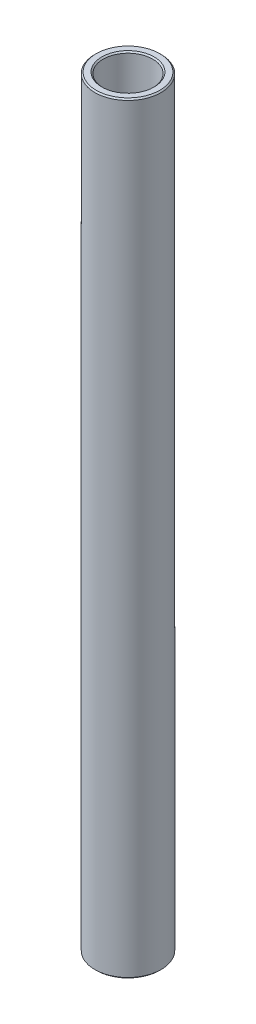
ISO-10303-21;
HEADER;
FILE_DESCRIPTION(('STEP AP214'),'2;1');
FILE_NAME('part.step','',(''),(''),'','','');
FILE_SCHEMA(('AUTOMOTIVE_DESIGN { 1 0 10303 214 1 1 1 1 }'));
ENDSEC;
DATA;
#1=APPLICATION_CONTEXT('core data for automotive mechanical design processes');
#2=APPLICATION_PROTOCOL_DEFINITION('international standard','automotive_design',2000,#1);
#3=PRODUCT_CONTEXT('',#1,'mechanical');
#4=PRODUCT('Part','Part','',(#3));
#5=PRODUCT_RELATED_PRODUCT_CATEGORY('part','',(#4));
#6=PRODUCT_DEFINITION_FORMATION('','',#4);
#7=PRODUCT_DEFINITION_CONTEXT('part definition',#1,'design');
#8=PRODUCT_DEFINITION('design','',#6,#7);
#9=PRODUCT_DEFINITION_SHAPE('','',#8);
#10=(LENGTH_UNIT() NAMED_UNIT(*) SI_UNIT(.MILLI.,.METRE.));
#11=(NAMED_UNIT(*) PLANE_ANGLE_UNIT() SI_UNIT($,.RADIAN.));
#12=(NAMED_UNIT(*) SI_UNIT($,.STERADIAN.) SOLID_ANGLE_UNIT());
#13=UNCERTAINTY_MEASURE_WITH_UNIT(LENGTH_MEASURE(1.E-05),#10,'distance_accuracy_value','');
#14=(GEOMETRIC_REPRESENTATION_CONTEXT(3) GLOBAL_UNCERTAINTY_ASSIGNED_CONTEXT((#13)) GLOBAL_UNIT_ASSIGNED_CONTEXT((#10,
#11,#12)) REPRESENTATION_CONTEXT('',''));
#15=CARTESIAN_POINT('',(0.,0.,0.));
#16=DIRECTION('',(0.,0.,1.));
#17=DIRECTION('',(1.,0.,0.));
#18=AXIS2_PLACEMENT_3D('',#15,#16,#17);
#19=CARTESIAN_POINT('',(0.,11.60859375,0.));
#20=DIRECTION('',(0.,1.,0.));
#21=DIRECTION('',(-1.,0.,0.));
#22=AXIS2_PLACEMENT_3D('',#19,#20,#21);
#23=CYLINDRICAL_SURFACE('',#22,4.7625);
#24=CARTESIAN_POINT('',(0.,-72.8630877,0.));
#25=DIRECTION('',(0.,1.,0.));
#26=DIRECTION('',(-1.,0.,0.));
#27=AXIS2_PLACEMENT_3D('',#24,#25,#26);
#28=CIRCLE('',#27,4.7625);
#29=CARTESIAN_POINT('',(-4.76250000000001,-72.8630877,0.));
#30=VERTEX_POINT('',#29);
#31=EDGE_CURVE('E50',#30,#30,#28,.F.);
#32=ORIENTED_EDGE('',*,*,#31,.T.);
#33=EDGE_LOOP('',(#32));
#34=FACE_BOUND('',#33,.T.);
#35=CARTESIAN_POINT('',(0.,72.8630877,0.));
#36=DIRECTION('',(0.,-1.,0.));
#37=DIRECTION('',(1.,0.,0.));
#38=AXIS2_PLACEMENT_3D('',#35,#36,#37);
#39=CIRCLE('',#38,4.7625);
#40=CARTESIAN_POINT('',(4.76250000000001,72.8630877,0.));
#41=VERTEX_POINT('',#40);
#42=EDGE_CURVE('E53',#41,#41,#39,.F.);
#43=ORIENTED_EDGE('',*,*,#42,.T.);
#44=EDGE_LOOP('',(#43));
#45=FACE_BOUND('',#44,.T.);
#46=ADVANCED_FACE('F30',(#34,#45),#23,.F.);
#47=CARTESIAN_POINT('',(4.76249999999999,73.1170877,0.));
#48=DIRECTION('',(0.,-1.,0.));
#49=DIRECTION('',(1.,0.,0.));
#50=AXIS2_PLACEMENT_3D('',#47,#48,#49);
#51=PLANE('',#50);
#52=CARTESIAN_POINT('',(0.,73.1170877,0.));
#53=DIRECTION('',(0.,-1.,0.));
#54=DIRECTION('',(1.,0.,0.));
#55=AXIS2_PLACEMENT_3D('',#52,#53,#54);
#56=CIRCLE('',#55,6.09600000000002);
#57=CARTESIAN_POINT('',(6.09600000000003,73.1170877,0.));
#58=VERTEX_POINT('',#57);
#59=EDGE_CURVE('E10',#58,#58,#56,.F.);
#60=ORIENTED_EDGE('',*,*,#59,.T.);
#61=EDGE_LOOP('',(#60));
#62=FACE_BOUND('',#61,.T.);
#63=CARTESIAN_POINT('',(0.,73.1170877,0.));
#64=DIRECTION('',(0.,-1.,0.));
#65=DIRECTION('',(1.,0.,0.));
#66=AXIS2_PLACEMENT_3D('',#63,#64,#65);
#67=CIRCLE('',#66,5.01650000000002);
#68=CARTESIAN_POINT('',(5.01650000000003,73.1170877,0.));
#69=VERTEX_POINT('',#68);
#70=EDGE_CURVE('E37',#69,#69,#67,.T.);
#71=ORIENTED_EDGE('',*,*,#70,.T.);
#72=EDGE_LOOP('',(#71));
#73=FACE_BOUND('',#72,.T.);
#74=ADVANCED_FACE('F76',(#62,#73),#51,.F.);
#75=CARTESIAN_POINT('',(0.,11.60859375,0.));
#76=DIRECTION('',(0.,1.,0.));
#77=DIRECTION('',(-1.,0.,0.));
#78=AXIS2_PLACEMENT_3D('',#75,#76,#77);
#79=CYLINDRICAL_SURFACE('',#78,6.35000000000002);
#80=CARTESIAN_POINT('',(0.,-72.8630877,0.));
#81=DIRECTION('',(0.,1.,0.));
#82=DIRECTION('',(-1.,0.,0.));
#83=AXIS2_PLACEMENT_3D('',#80,#81,#82);
#84=CIRCLE('',#83,6.35000000000002);
#85=CARTESIAN_POINT('',(-6.35000000000002,-72.8630877,0.));
#86=VERTEX_POINT('',#85);
#87=EDGE_CURVE('E41',#86,#86,#84,.T.);
#88=ORIENTED_EDGE('',*,*,#87,.T.);
#89=EDGE_LOOP('',(#88));
#90=FACE_BOUND('',#89,.T.);
#91=CARTESIAN_POINT('',(0.,72.8630877,0.));
#92=DIRECTION('',(0.,-1.,0.));
#93=DIRECTION('',(1.,0.,0.));
#94=AXIS2_PLACEMENT_3D('',#91,#92,#93);
#95=CIRCLE('',#94,6.35000000000002);
#96=CARTESIAN_POINT('',(6.35000000000003,72.8630877,0.));
#97=VERTEX_POINT('',#96);
#98=EDGE_CURVE('E45',#97,#97,#95,.T.);
#99=ORIENTED_EDGE('',*,*,#98,.T.);
#100=EDGE_LOOP('',(#99));
#101=FACE_BOUND('',#100,.T.);
#102=ADVANCED_FACE('F73',(#90,#101),#79,.T.);
#103=CARTESIAN_POINT('',(6.35000000000003,-73.1170877,0.));
#104=DIRECTION('',(0.,1.,0.));
#105=DIRECTION('',(-1.,0.,0.));
#106=AXIS2_PLACEMENT_3D('',#103,#104,#105);
#107=PLANE('',#106);
#108=CARTESIAN_POINT('',(0.,-73.1170877,0.));
#109=DIRECTION('',(0.,1.,0.));
#110=DIRECTION('',(-1.,0.,0.));
#111=AXIS2_PLACEMENT_3D('',#108,#109,#110);
#112=CIRCLE('',#111,5.01649999999999);
#113=CARTESIAN_POINT('',(-5.0165,-73.1170877,0.));
#114=VERTEX_POINT('',#113);
#115=EDGE_CURVE('E56',#114,#114,#112,.T.);
#116=ORIENTED_EDGE('',*,*,#115,.T.);
#117=EDGE_LOOP('',(#116));
#118=FACE_BOUND('',#117,.T.);
#119=CARTESIAN_POINT('',(0.,-73.1170877,0.));
#120=DIRECTION('',(0.,1.,0.));
#121=DIRECTION('',(-1.,0.,0.));
#122=AXIS2_PLACEMENT_3D('',#119,#120,#121);
#123=CIRCLE('',#122,6.09599999999999);
#124=CARTESIAN_POINT('',(-6.096,-73.1170877,0.));
#125=VERTEX_POINT('',#124);
#126=EDGE_CURVE('E59',#125,#125,#123,.F.);
#127=ORIENTED_EDGE('',*,*,#126,.T.);
#128=EDGE_LOOP('',(#127));
#129=FACE_BOUND('',#128,.T.);
#130=ADVANCED_FACE('F63',(#118,#129),#107,.F.);
#131=CARTESIAN_POINT('',(0.,-73.1170877,0.));
#132=DIRECTION('',(0.,-1.,0.));
#133=DIRECTION('',(1.,0.,0.));
#134=AXIS2_PLACEMENT_3D('',#131,#132,#133);
#135=CONICAL_SURFACE('',#134,5.01649999999999,0.785398163397424);
#136=ORIENTED_EDGE('',*,*,#31,.F.);
#137=EDGE_LOOP('',(#136));
#138=FACE_BOUND('',#137,.T.);
#139=ORIENTED_EDGE('',*,*,#115,.F.);
#140=EDGE_LOOP('',(#139));
#141=FACE_BOUND('',#140,.T.);
#142=ADVANCED_FACE('F69',(#138,#141),#135,.F.);
#143=CARTESIAN_POINT('',(0.,-72.8630877,0.));
#144=DIRECTION('',(0.,1.,0.));
#145=DIRECTION('',(-1.,0.,0.));
#146=AXIS2_PLACEMENT_3D('',#143,#144,#145);
#147=CONICAL_SURFACE('',#146,6.35000000000002,0.785398163397464);
#148=ORIENTED_EDGE('',*,*,#126,.F.);
#149=EDGE_LOOP('',(#148));
#150=FACE_BOUND('',#149,.T.);
#151=ORIENTED_EDGE('',*,*,#87,.F.);
#152=EDGE_LOOP('',(#151));
#153=FACE_BOUND('',#152,.T.);
#154=ADVANCED_FACE('F65',(#150,#153),#147,.T.);
#155=CARTESIAN_POINT('',(0.,73.1170877,0.));
#156=DIRECTION('',(0.,-1.,0.));
#157=DIRECTION('',(1.,0.,0.));
#158=AXIS2_PLACEMENT_3D('',#155,#156,#157);
#159=CONICAL_SURFACE('',#158,6.09600000000002,0.785398163397465);
#160=ORIENTED_EDGE('',*,*,#98,.F.);
#161=EDGE_LOOP('',(#160));
#162=FACE_BOUND('',#161,.T.);
#163=ORIENTED_EDGE('',*,*,#59,.F.);
#164=EDGE_LOOP('',(#163));
#165=FACE_BOUND('',#164,.T.);
#166=ADVANCED_FACE('F68',(#162,#165),#159,.T.);
#167=CARTESIAN_POINT('',(0.,72.8630877,0.));
#168=DIRECTION('',(0.,1.,0.));
#169=DIRECTION('',(-1.,0.,0.));
#170=AXIS2_PLACEMENT_3D('',#167,#168,#169);
#171=CONICAL_SURFACE('',#170,4.7625,0.785398163397452);
#172=ORIENTED_EDGE('',*,*,#70,.F.);
#173=EDGE_LOOP('',(#172));
#174=FACE_BOUND('',#173,.T.);
#175=ORIENTED_EDGE('',*,*,#42,.F.);
#176=EDGE_LOOP('',(#175));
#177=FACE_BOUND('',#176,.T.);
#178=ADVANCED_FACE('F32',(#174,#177),#171,.F.);
#179=CLOSED_SHELL('',(#46,#74,#102,#130,#142,#154,#166,#178));
#180=MANIFOLD_SOLID_BREP('B2',#179);
#181=ADVANCED_BREP_SHAPE_REPRESENTATION('',(#18,#180),#14);
#182=SHAPE_DEFINITION_REPRESENTATION(#9,#181);
ENDSEC;
END-ISO-10303-21;
